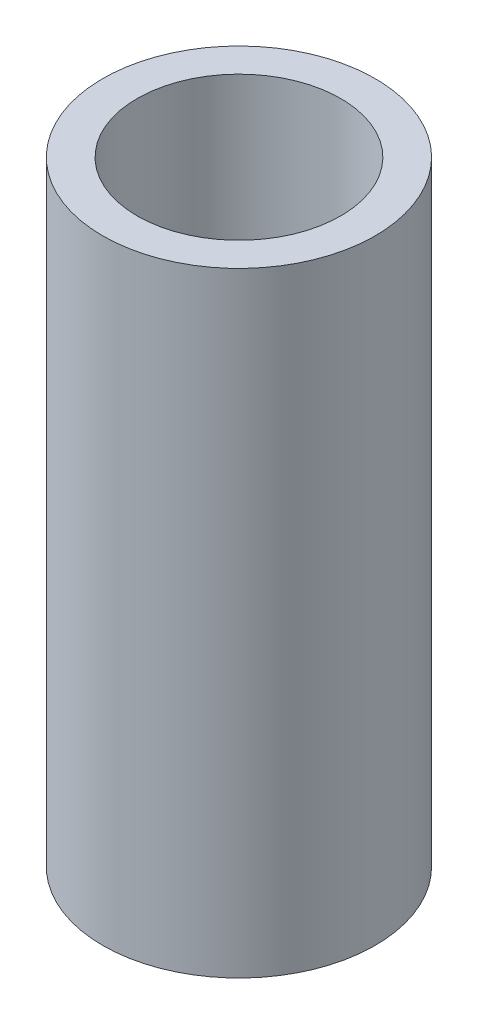
ISO-10303-21;
HEADER;
FILE_DESCRIPTION(('STEP AP214'),'2;1');
FILE_NAME('part.step','',(''),(''),'','','');
FILE_SCHEMA(('AUTOMOTIVE_DESIGN { 1 0 10303 214 1 1 1 1 }'));
ENDSEC;
DATA;
#1=APPLICATION_CONTEXT('core data for automotive mechanical design processes');
#2=APPLICATION_PROTOCOL_DEFINITION('international standard','automotive_design',2000,#1);
#3=PRODUCT_CONTEXT('',#1,'mechanical');
#4=PRODUCT('Part','Part','',(#3));
#5=PRODUCT_RELATED_PRODUCT_CATEGORY('part','',(#4));
#6=PRODUCT_DEFINITION_FORMATION('','',#4);
#7=PRODUCT_DEFINITION_CONTEXT('part definition',#1,'design');
#8=PRODUCT_DEFINITION('design','',#6,#7);
#9=PRODUCT_DEFINITION_SHAPE('','',#8);
#10=(LENGTH_UNIT() NAMED_UNIT(*) SI_UNIT(.MILLI.,.METRE.));
#11=(NAMED_UNIT(*) PLANE_ANGLE_UNIT() SI_UNIT($,.RADIAN.));
#12=(NAMED_UNIT(*) SI_UNIT($,.STERADIAN.) SOLID_ANGLE_UNIT());
#13=UNCERTAINTY_MEASURE_WITH_UNIT(LENGTH_MEASURE(1.E-05),#10,'distance_accuracy_value','');
#14=(GEOMETRIC_REPRESENTATION_CONTEXT(3) GLOBAL_UNCERTAINTY_ASSIGNED_CONTEXT((#13)) GLOBAL_UNIT_ASSIGNED_CONTEXT((#10,
#11,#12)) REPRESENTATION_CONTEXT('',''));
#15=CARTESIAN_POINT('',(0.,0.,0.));
#16=DIRECTION('',(0.,0.,1.));
#17=DIRECTION('',(1.,0.,0.));
#18=AXIS2_PLACEMENT_3D('',#15,#16,#17);
#19=CARTESIAN_POINT('',(0.,67.6745126136126,0.));
#20=DIRECTION('',(0.,-1.,0.));
#21=DIRECTION('',(0.,0.,-1.));
#22=AXIS2_PLACEMENT_3D('',#19,#20,#21);
#23=CYLINDRICAL_SURFACE('',#22,15.);
#24=CARTESIAN_POINT('',(0.,67.6745126136126,0.));
#25=DIRECTION('',(0.,1.,0.));
#26=DIRECTION('',(0.,0.,1.));
#27=AXIS2_PLACEMENT_3D('',#24,#25,#26);
#28=CIRCLE('',#27,15.);
#29=CARTESIAN_POINT('',(0.,67.6745126136126,15.));
#30=VERTEX_POINT('',#29);
#31=EDGE_CURVE('E10',#30,#30,#28,.T.);
#32=ORIENTED_EDGE('',*,*,#31,.F.);
#33=EDGE_LOOP('',(#32));
#34=FACE_BOUND('',#33,.T.);
#35=CARTESIAN_POINT('',(0.,0.,0.));
#36=DIRECTION('',(0.,1.,0.));
#37=DIRECTION('',(0.,0.,1.));
#38=AXIS2_PLACEMENT_3D('',#35,#36,#37);
#39=CIRCLE('',#38,15.);
#40=CARTESIAN_POINT('',(0.,0.,15.));
#41=VERTEX_POINT('',#40);
#42=EDGE_CURVE('E37',#41,#41,#39,.T.);
#43=ORIENTED_EDGE('',*,*,#42,.T.);
#44=EDGE_LOOP('',(#43));
#45=FACE_BOUND('',#44,.T.);
#46=ADVANCED_FACE('F40',(#34,#45),#23,.T.);
#47=CARTESIAN_POINT('',(0.,67.6745126136126,0.));
#48=DIRECTION('',(0.,1.,0.));
#49=DIRECTION('',(0.,0.,1.));
#50=AXIS2_PLACEMENT_3D('',#47,#48,#49);
#51=PLANE('',#50);
#52=CARTESIAN_POINT('',(0.,67.6745126136126,0.));
#53=DIRECTION('',(0.,1.,0.));
#54=DIRECTION('',(0.,0.,1.));
#55=AXIS2_PLACEMENT_3D('',#52,#53,#54);
#56=CIRCLE('',#55,11.2065417778575);
#57=CARTESIAN_POINT('',(0.,67.6745126136126,11.2065417778575));
#58=VERTEX_POINT('',#57);
#59=EDGE_CURVE('E50',#58,#58,#56,.T.);
#60=ORIENTED_EDGE('',*,*,#59,.F.);
#61=EDGE_LOOP('',(#60));
#62=FACE_BOUND('',#61,.T.);
#63=ORIENTED_EDGE('',*,*,#31,.T.);
#64=EDGE_LOOP('',(#63));
#65=FACE_BOUND('',#64,.T.);
#66=ADVANCED_FACE('F59',(#62,#65),#51,.T.);
#67=CARTESIAN_POINT('',(0.,0.,0.));
#68=DIRECTION('',(0.,1.,0.));
#69=DIRECTION('',(0.,0.,1.));
#70=AXIS2_PLACEMENT_3D('',#67,#68,#69);
#71=PLANE('',#70);
#72=CARTESIAN_POINT('',(0.,0.,0.));
#73=DIRECTION('',(0.,1.,0.));
#74=DIRECTION('',(0.,0.,1.));
#75=AXIS2_PLACEMENT_3D('',#72,#73,#74);
#76=CIRCLE('',#75,11.2065417778575);
#77=CARTESIAN_POINT('',(0.,0.,11.2065417778575));
#78=VERTEX_POINT('',#77);
#79=EDGE_CURVE('E47',#78,#78,#76,.T.);
#80=ORIENTED_EDGE('',*,*,#79,.T.);
#81=EDGE_LOOP('',(#80));
#82=FACE_BOUND('',#81,.T.);
#83=ORIENTED_EDGE('',*,*,#42,.F.);
#84=EDGE_LOOP('',(#83));
#85=FACE_BOUND('',#84,.T.);
#86=ADVANCED_FACE('F58',(#82,#85),#71,.F.);
#87=CARTESIAN_POINT('',(0.,67.6745126136126,0.));
#88=DIRECTION('',(0.,-1.,0.));
#89=DIRECTION('',(0.,0.,-1.));
#90=AXIS2_PLACEMENT_3D('',#87,#88,#89);
#91=CYLINDRICAL_SURFACE('',#90,11.2065417778575);
#92=ORIENTED_EDGE('',*,*,#59,.T.);
#93=EDGE_LOOP('',(#92));
#94=FACE_BOUND('',#93,.T.);
#95=ORIENTED_EDGE('',*,*,#79,.F.);
#96=EDGE_LOOP('',(#95));
#97=FACE_BOUND('',#96,.T.);
#98=ADVANCED_FACE('F54',(#94,#97),#91,.F.);
#99=CLOSED_SHELL('',(#46,#66,#86,#98));
#100=MANIFOLD_SOLID_BREP('B2',#99);
#101=ADVANCED_BREP_SHAPE_REPRESENTATION('',(#18,#100),#14);
#102=SHAPE_DEFINITION_REPRESENTATION(#9,#101);
ENDSEC;
END-ISO-10303-21;
